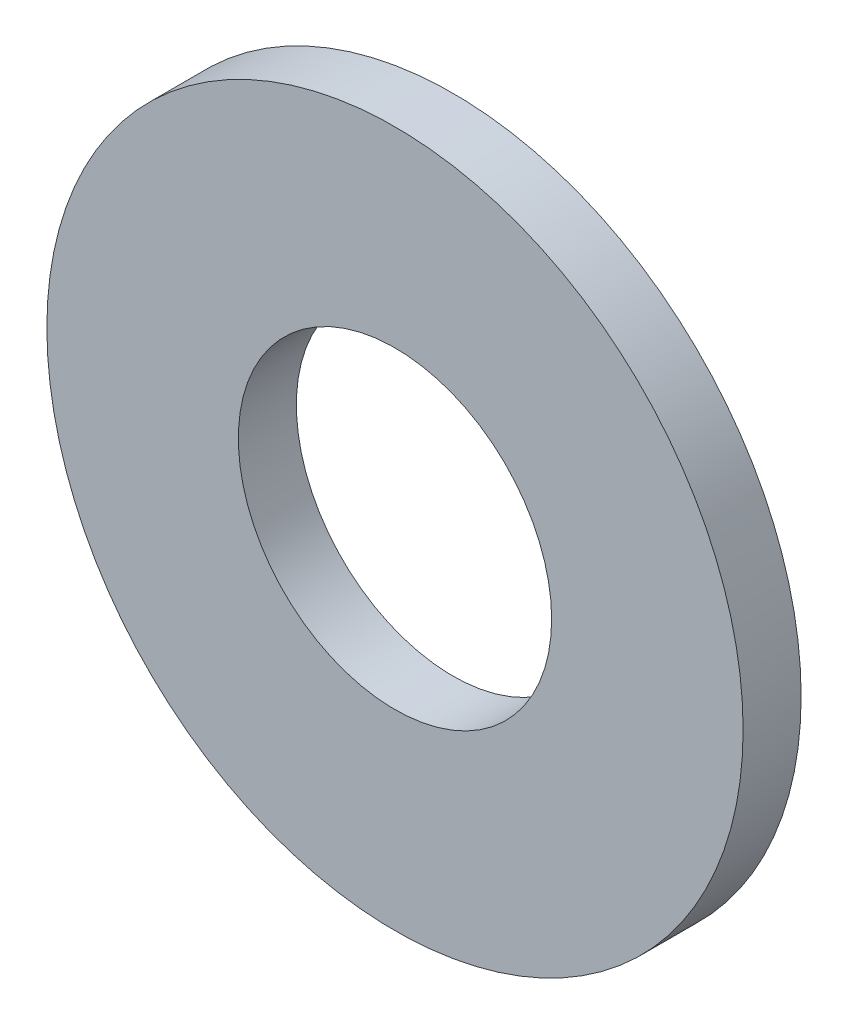
ISO-10303-21;
HEADER;
FILE_DESCRIPTION(('STEP AP214'),'2;1');
FILE_NAME('part.step','',(''),(''),'','','');
FILE_SCHEMA(('AUTOMOTIVE_DESIGN { 1 0 10303 214 1 1 1 1 }'));
ENDSEC;
DATA;
#1=APPLICATION_CONTEXT('core data for automotive mechanical design processes');
#2=APPLICATION_PROTOCOL_DEFINITION('international standard','automotive_design',2000,#1);
#3=PRODUCT_CONTEXT('',#1,'mechanical');
#4=PRODUCT('Part','Part','',(#3));
#5=PRODUCT_RELATED_PRODUCT_CATEGORY('part','',(#4));
#6=PRODUCT_DEFINITION_FORMATION('','',#4);
#7=PRODUCT_DEFINITION_CONTEXT('part definition',#1,'design');
#8=PRODUCT_DEFINITION('design','',#6,#7);
#9=PRODUCT_DEFINITION_SHAPE('','',#8);
#10=(LENGTH_UNIT() NAMED_UNIT(*) SI_UNIT(.MILLI.,.METRE.));
#11=(NAMED_UNIT(*) PLANE_ANGLE_UNIT() SI_UNIT($,.RADIAN.));
#12=(NAMED_UNIT(*) SI_UNIT($,.STERADIAN.) SOLID_ANGLE_UNIT());
#13=UNCERTAINTY_MEASURE_WITH_UNIT(LENGTH_MEASURE(1.E-05),#10,'distance_accuracy_value','');
#14=(GEOMETRIC_REPRESENTATION_CONTEXT(3) GLOBAL_UNCERTAINTY_ASSIGNED_CONTEXT((#13)) GLOBAL_UNIT_ASSIGNED_CONTEXT((#10,
#11,#12)) REPRESENTATION_CONTEXT('',''));
#15=CARTESIAN_POINT('',(0.,0.,0.));
#16=DIRECTION('',(0.,0.,1.));
#17=DIRECTION('',(1.,0.,0.));
#18=AXIS2_PLACEMENT_3D('',#15,#16,#17);
#19=CARTESIAN_POINT('',(0.,0.,0.5));
#20=DIRECTION('',(0.,0.,1.));
#21=DIRECTION('',(1.,0.,0.));
#22=AXIS2_PLACEMENT_3D('',#19,#20,#21);
#23=PLANE('',#22);
#24=CARTESIAN_POINT('',(0.,0.,0.5));
#25=DIRECTION('',(0.,0.,1.));
#26=DIRECTION('',(1.,0.,0.));
#27=AXIS2_PLACEMENT_3D('',#24,#25,#26);
#28=CIRCLE('',#27,3.);
#29=CARTESIAN_POINT('',(3.,0.,0.5));
#30=VERTEX_POINT('',#29);
#31=EDGE_CURVE('E10',#30,#30,#28,.T.);
#32=ORIENTED_EDGE('',*,*,#31,.T.);
#33=EDGE_LOOP('',(#32));
#34=FACE_BOUND('',#33,.T.);
#35=CARTESIAN_POINT('',(0.,0.,0.5));
#36=DIRECTION('',(0.,0.,1.));
#37=DIRECTION('',(1.,0.,0.));
#38=AXIS2_PLACEMENT_3D('',#35,#36,#37);
#39=CIRCLE('',#38,1.35);
#40=CARTESIAN_POINT('',(1.35,0.,0.5));
#41=VERTEX_POINT('',#40);
#42=EDGE_CURVE('E41',#41,#41,#39,.T.);
#43=ORIENTED_EDGE('',*,*,#42,.F.);
#44=EDGE_LOOP('',(#43));
#45=FACE_BOUND('',#44,.T.);
#46=ADVANCED_FACE('F30',(#34,#45),#23,.T.);
#47=CARTESIAN_POINT('',(0.,0.,0.));
#48=DIRECTION('',(0.,0.,1.));
#49=DIRECTION('',(1.,0.,0.));
#50=AXIS2_PLACEMENT_3D('',#47,#48,#49);
#51=PLANE('',#50);
#52=CARTESIAN_POINT('',(0.,0.,0.));
#53=DIRECTION('',(0.,0.,1.));
#54=DIRECTION('',(1.,0.,0.));
#55=AXIS2_PLACEMENT_3D('',#52,#53,#54);
#56=CIRCLE('',#55,3.);
#57=CARTESIAN_POINT('',(3.,0.,0.));
#58=VERTEX_POINT('',#57);
#59=EDGE_CURVE('E34',#58,#58,#56,.T.);
#60=ORIENTED_EDGE('',*,*,#59,.F.);
#61=EDGE_LOOP('',(#60));
#62=FACE_BOUND('',#61,.T.);
#63=CARTESIAN_POINT('',(0.,0.,0.));
#64=DIRECTION('',(0.,0.,1.));
#65=DIRECTION('',(1.,0.,0.));
#66=AXIS2_PLACEMENT_3D('',#63,#64,#65);
#67=CIRCLE('',#66,1.35);
#68=CARTESIAN_POINT('',(1.35,0.,0.));
#69=VERTEX_POINT('',#68);
#70=EDGE_CURVE('E43',#69,#69,#67,.T.);
#71=ORIENTED_EDGE('',*,*,#70,.T.);
#72=EDGE_LOOP('',(#71));
#73=FACE_BOUND('',#72,.T.);
#74=ADVANCED_FACE('F53',(#62,#73),#51,.F.);
#75=CARTESIAN_POINT('',(0.,0.,0.5));
#76=DIRECTION('',(0.,0.,-1.));
#77=DIRECTION('',(-1.,0.,0.));
#78=AXIS2_PLACEMENT_3D('',#75,#76,#77);
#79=CYLINDRICAL_SURFACE('',#78,3.);
#80=ORIENTED_EDGE('',*,*,#31,.F.);
#81=EDGE_LOOP('',(#80));
#82=FACE_BOUND('',#81,.T.);
#83=ORIENTED_EDGE('',*,*,#59,.T.);
#84=EDGE_LOOP('',(#83));
#85=FACE_BOUND('',#84,.T.);
#86=ADVANCED_FACE('F32',(#82,#85),#79,.T.);
#87=CARTESIAN_POINT('',(0.,0.,0.5));
#88=DIRECTION('',(0.,0.,-1.));
#89=DIRECTION('',(-1.,0.,0.));
#90=AXIS2_PLACEMENT_3D('',#87,#88,#89);
#91=CYLINDRICAL_SURFACE('',#90,1.35);
#92=ORIENTED_EDGE('',*,*,#42,.T.);
#93=EDGE_LOOP('',(#92));
#94=FACE_BOUND('',#93,.T.);
#95=ORIENTED_EDGE('',*,*,#70,.F.);
#96=EDGE_LOOP('',(#95));
#97=FACE_BOUND('',#96,.T.);
#98=ADVANCED_FACE('F49',(#94,#97),#91,.F.);
#99=CLOSED_SHELL('',(#46,#74,#86,#98));
#100=MANIFOLD_SOLID_BREP('B2',#99);
#101=ADVANCED_BREP_SHAPE_REPRESENTATION('',(#18,#100),#14);
#102=SHAPE_DEFINITION_REPRESENTATION(#9,#101);
ENDSEC;
END-ISO-10303-21;
